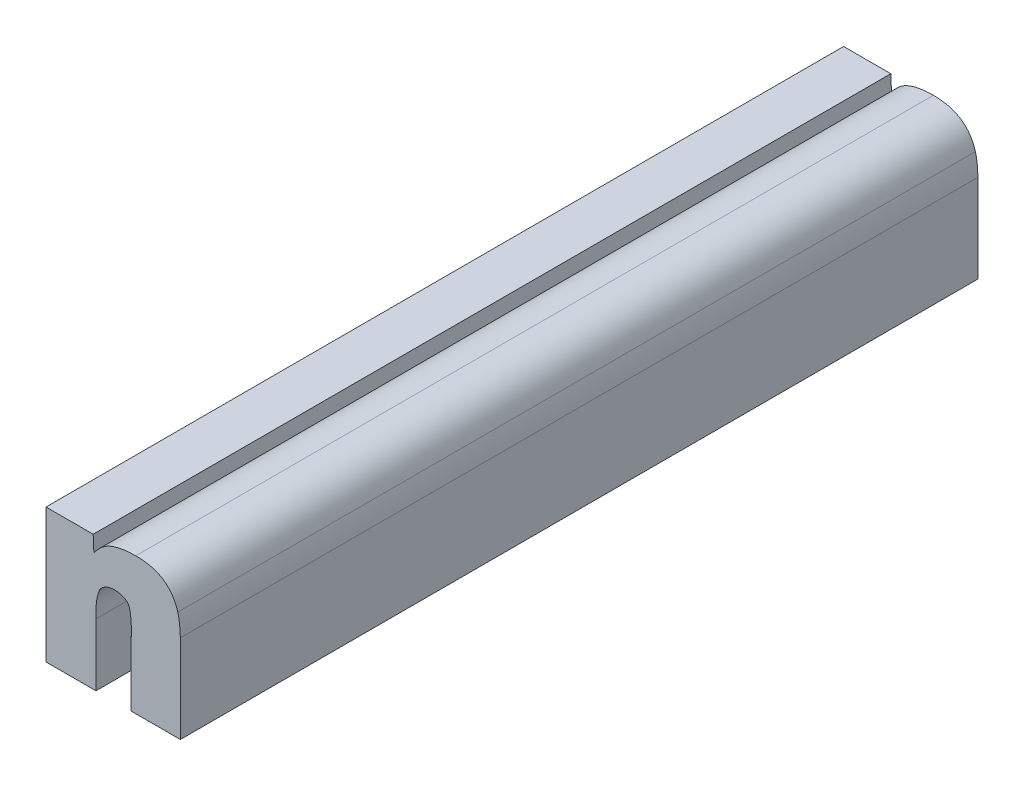
ISO-10303-21;
HEADER;
FILE_DESCRIPTION(('STEP AP214'),'2;1');
FILE_NAME('part.step','',(''),(''),'','','');
FILE_SCHEMA(('AUTOMOTIVE_DESIGN { 1 0 10303 214 1 1 1 1 }'));
ENDSEC;
DATA;
#1=APPLICATION_CONTEXT('core data for automotive mechanical design processes');
#2=APPLICATION_PROTOCOL_DEFINITION('international standard','automotive_design',2000,#1);
#3=PRODUCT_CONTEXT('',#1,'mechanical');
#4=PRODUCT('Part','Part','',(#3));
#5=PRODUCT_RELATED_PRODUCT_CATEGORY('part','',(#4));
#6=PRODUCT_DEFINITION_FORMATION('','',#4);
#7=PRODUCT_DEFINITION_CONTEXT('part definition',#1,'design');
#8=PRODUCT_DEFINITION('design','',#6,#7);
#9=PRODUCT_DEFINITION_SHAPE('','',#8);
#10=(LENGTH_UNIT() NAMED_UNIT(*) SI_UNIT(.MILLI.,.METRE.));
#11=(NAMED_UNIT(*) PLANE_ANGLE_UNIT() SI_UNIT($,.RADIAN.));
#12=(NAMED_UNIT(*) SI_UNIT($,.STERADIAN.) SOLID_ANGLE_UNIT());
#13=UNCERTAINTY_MEASURE_WITH_UNIT(LENGTH_MEASURE(1.E-05),#10,'distance_accuracy_value','');
#14=(GEOMETRIC_REPRESENTATION_CONTEXT(3) GLOBAL_UNCERTAINTY_ASSIGNED_CONTEXT((#13)) GLOBAL_UNIT_ASSIGNED_CONTEXT((#10,
#11,#12)) REPRESENTATION_CONTEXT('',''));
#15=CARTESIAN_POINT('',(0.,0.,0.));
#16=DIRECTION('',(0.,0.,1.));
#17=DIRECTION('',(1.,0.,0.));
#18=AXIS2_PLACEMENT_3D('',#15,#16,#17);
#19=CARTESIAN_POINT('',(1.3371923271056,0.0341772309982742,0.));
#20=DIRECTION('',(-1.,0.,0.));
#21=DIRECTION('',(0.,-1.,0.));
#22=AXIS2_PLACEMENT_3D('',#19,#20,#21);
#23=PLANE('',#22);
#24=DIRECTION('',(0.,-1.,0.));
#25=VECTOR('',#24,1.);
#26=CARTESIAN_POINT('',(1.3371923271056,0.0341772309982742,0.));
#27=LINE('',#26,#25);
#28=CARTESIAN_POINT('',(1.3371923271056,0.0341772309982742,0.));
#29=VERTEX_POINT('',#28);
#30=CARTESIAN_POINT('',(1.3371923271056,0.0173482363776242,0.));
#31=VERTEX_POINT('',#30);
#32=EDGE_CURVE('E11',#29,#31,#27,.T.);
#33=ORIENTED_EDGE('',*,*,#32,.T.);
#34=DIRECTION('',(0.,0.,1.));
#35=VECTOR('',#34,1.);
#36=CARTESIAN_POINT('',(1.3371923271056,0.0173482363776242,0.));
#37=LINE('',#36,#35);
#38=CARTESIAN_POINT('',(1.3371923271056,0.0173482363776242,0.1));
#39=VERTEX_POINT('',#38);
#40=EDGE_CURVE('E24',#31,#39,#37,.T.);
#41=ORIENTED_EDGE('',*,*,#40,.T.);
#42=DIRECTION('',(0.,-1.,0.));
#43=VECTOR('',#42,1.);
#44=CARTESIAN_POINT('',(1.3371923271056,0.0341772309982742,0.1));
#45=LINE('',#44,#43);
#46=CARTESIAN_POINT('',(1.3371923271056,0.0341772309982742,0.1));
#47=VERTEX_POINT('',#46);
#48=EDGE_CURVE('E142',#47,#39,#45,.T.);
#49=ORIENTED_EDGE('',*,*,#48,.F.);
#50=DIRECTION('',(0.,0.,1.));
#51=VECTOR('',#50,1.);
#52=CARTESIAN_POINT('',(1.3371923271056,0.0341772309982742,0.));
#53=LINE('',#52,#51);
#54=EDGE_CURVE('E321',#29,#47,#53,.T.);
#55=ORIENTED_EDGE('',*,*,#54,.F.);
#56=EDGE_LOOP('',(#33,#41,#49,#55));
#57=FACE_BOUND('',#56,.T.);
#58=ADVANCED_FACE('F17',(#57),#23,.T.);
#59=CARTESIAN_POINT('',(1.3431074051493,0.0341772309982742,0.));
#60=DIRECTION('',(0.,1.,0.));
#61=DIRECTION('',(-1.,0.,0.));
#62=AXIS2_PLACEMENT_3D('',#59,#60,#61);
#63=PLANE('',#62);
#64=DIRECTION('',(-1.,0.,0.));
#65=VECTOR('',#64,1.);
#66=CARTESIAN_POINT('',(1.3431074051493,0.0341772309982742,0.));
#67=LINE('',#66,#65);
#68=CARTESIAN_POINT('',(1.3431074051493,0.0341772309982742,0.));
#69=VERTEX_POINT('',#68);
#70=EDGE_CURVE('E318',#69,#29,#67,.T.);
#71=ORIENTED_EDGE('',*,*,#70,.T.);
#72=ORIENTED_EDGE('',*,*,#54,.T.);
#73=DIRECTION('',(-1.,0.,0.));
#74=VECTOR('',#73,1.);
#75=CARTESIAN_POINT('',(1.3431074051493,0.0341772309982742,0.1));
#76=LINE('',#75,#74);
#77=CARTESIAN_POINT('',(1.3431074051493,0.0341772309982742,0.1));
#78=VERTEX_POINT('',#77);
#79=EDGE_CURVE('E316',#78,#47,#76,.T.);
#80=ORIENTED_EDGE('',*,*,#79,.F.);
#81=DIRECTION('',(0.,0.,1.));
#82=VECTOR('',#81,1.);
#83=CARTESIAN_POINT('',(1.3431074051493,0.0341772309982742,0.));
#84=LINE('',#83,#82);
#85=EDGE_CURVE('E313',#69,#78,#84,.T.);
#86=ORIENTED_EDGE('',*,*,#85,.F.);
#87=EDGE_LOOP('',(#71,#72,#80,#86));
#88=FACE_BOUND('',#87,.T.);
#89=ADVANCED_FACE('F359',(#88),#63,.T.);
#90=CARTESIAN_POINT('',(1.3431943933759,0.0322229346359742,0.));
#91=DIRECTION('',(0.999010842697868,0.0444672483081271,0.));
#92=DIRECTION('',(-0.0444672483081271,0.999010842697868,0.));
#93=AXIS2_PLACEMENT_3D('',#90,#91,#92);
#94=PLANE('',#93);
#95=DIRECTION('',(-0.0444672483081271,0.999010842697868,0.));
#96=VECTOR('',#95,1.);
#97=CARTESIAN_POINT('',(1.3431943933759,0.0322229346359742,0.));
#98=LINE('',#97,#96);
#99=CARTESIAN_POINT('',(1.3431943933759,0.0322229346359742,0.));
#100=VERTEX_POINT('',#99);
#101=EDGE_CURVE('E310',#100,#69,#98,.T.);
#102=ORIENTED_EDGE('',*,*,#101,.T.);
#103=ORIENTED_EDGE('',*,*,#85,.T.);
#104=DIRECTION('',(-0.0444672483081271,0.999010842697868,0.));
#105=VECTOR('',#104,1.);
#106=CARTESIAN_POINT('',(1.3431943933759,0.0322229346359742,0.1));
#107=LINE('',#106,#105);
#108=CARTESIAN_POINT('',(1.3431943933759,0.0322229346359742,0.1));
#109=VERTEX_POINT('',#108);
#110=EDGE_CURVE('E307',#109,#78,#107,.T.);
#111=ORIENTED_EDGE('',*,*,#110,.F.);
#112=DIRECTION('',(0.,0.,1.));
#113=VECTOR('',#112,1.);
#114=CARTESIAN_POINT('',(1.3431943933759,0.0322229346359742,0.));
#115=LINE('',#114,#113);
#116=EDGE_CURVE('E301',#100,#109,#115,.T.);
#117=ORIENTED_EDGE('',*,*,#116,.F.);
#118=EDGE_LOOP('',(#102,#103,#111,#117));
#119=FACE_BOUND('',#118,.T.);
#120=ADVANCED_FACE('F356',(#119),#94,.T.);
#121=CARTESIAN_POINT('',(1.3484425809153,0.0345019804122742,0.));
#122=CARTESIAN_POINT('',(1.3484425809153,0.0345019804122742,0.1));
#123=CARTESIAN_POINT('',(1.3449631214529,0.0345019804386324,0.));
#124=CARTESIAN_POINT('',(1.3449631214529,0.0345019804386324,0.1));
#125=CARTESIAN_POINT('',(1.3440062708754,0.0332174735107256,0.));
#126=CARTESIAN_POINT('',(1.3440062708754,0.0332174735107256,0.1));
#127=CARTESIAN_POINT('',(1.3431943933759,0.0322229346359742,0.));
#128=CARTESIAN_POINT('',(1.3431943933759,0.0322229346359742,0.1));
#129=B_SPLINE_SURFACE_WITH_KNOTS('',3,1,((#121,#122),(#123,#124),(#125,#126),(#127,#128)),
.UNSPECIFIED.,.F.,.F.,.F.,(4,4),(2,2),(0.,1.),(0.,0.01),.UNSPECIFIED.);
#130=CARTESIAN_POINT('',(1.3484425809153,0.0345019804122742,0.));
#131=CARTESIAN_POINT('',(1.3449631214529,0.0345019804386324,0.));
#132=CARTESIAN_POINT('',(1.3440062708754,0.0332174735107256,0.));
#133=CARTESIAN_POINT('',(1.3431943933759,0.0322229346359742,0.));
#134=B_SPLINE_CURVE_WITH_KNOTS('',3,(#130,#131,#132,#133),.UNSPECIFIED.,.F.,.F.,(4,4),(0.,1.),.UNSPECIFIED.);
#135=CARTESIAN_POINT('',(1.3484425809153,0.0345019804122742,0.));
#136=VERTEX_POINT('',#135);
#137=EDGE_CURVE('E293',#136,#100,#134,.T.);
#138=CARTESIAN_POINT('',(1.3484425809153,0.0345019804122742,0.1));
#139=CARTESIAN_POINT('',(1.3449631214529,0.0345019804386324,0.1));
#140=CARTESIAN_POINT('',(1.3440062708754,0.0332174735107256,0.1));
#141=CARTESIAN_POINT('',(1.3431943933759,0.0322229346359742,0.1));
#142=B_SPLINE_CURVE_WITH_KNOTS('',3,(#138,#139,#140,#141),.UNSPECIFIED.,.F.,.F.,(4,4),(0.,1.),.UNSPECIFIED.);
#143=CARTESIAN_POINT('',(1.3484425809153,0.0345019804122742,0.1));
#144=VERTEX_POINT('',#143);
#145=EDGE_CURVE('E288',#144,#109,#142,.T.);
#146=DIRECTION('',(0.,0.,1.));
#147=VECTOR('',#146,1.);
#148=CARTESIAN_POINT('',(1.3484425809153,0.0345019804122742,0.));
#149=LINE('',#148,#147);
#150=EDGE_CURVE('E282',#136,#144,#149,.T.);
#151=ORIENTED_EDGE('',*,*,#137,.T.);
#152=ORIENTED_EDGE('',*,*,#116,.T.);
#153=ORIENTED_EDGE('',*,*,#145,.F.);
#154=ORIENTED_EDGE('',*,*,#150,.F.);
#155=EDGE_LOOP('',(#151,#152,#153,#154));
#156=FACE_BOUND('',#155,.T.);
#157=ADVANCED_FACE('F353',(#156),#129,.T.);
#158=CARTESIAN_POINT('',(1.3537197678463,0.0310283168829742,0.));
#159=CARTESIAN_POINT('',(1.3537197678463,0.0310283168829742,0.1));
#160=CARTESIAN_POINT('',(1.3529368877207,0.0336118174063003,0.));
#161=CARTESIAN_POINT('',(1.3529368877207,0.0336118174063003,0.1));
#162=CARTESIAN_POINT('',(1.3509941891386,0.0345019803742512,0.));
#163=CARTESIAN_POINT('',(1.3509941891386,0.0345019803742512,0.1));
#164=CARTESIAN_POINT('',(1.3484425809153,0.0345019804122742,0.));
#165=CARTESIAN_POINT('',(1.3484425809153,0.0345019804122742,0.1));
#166=B_SPLINE_SURFACE_WITH_KNOTS('',3,1,((#158,#159),(#160,#161),(#162,#163),(#164,#165)),
.UNSPECIFIED.,.F.,.F.,.F.,(4,4),(2,2),(0.,1.),(0.,0.01),.UNSPECIFIED.);
#167=CARTESIAN_POINT('',(1.3537197678463,0.0310283168829742,0.));
#168=CARTESIAN_POINT('',(1.3529368877207,0.0336118174063003,0.));
#169=CARTESIAN_POINT('',(1.3509941891386,0.0345019803742512,0.));
#170=CARTESIAN_POINT('',(1.3484425809153,0.0345019804122742,0.));
#171=B_SPLINE_CURVE_WITH_KNOTS('',3,(#167,#168,#169,#170),.UNSPECIFIED.,.F.,.F.,(4,4),(0.,1.),.UNSPECIFIED.);
#172=CARTESIAN_POINT('',(1.3537197678463,0.0310283168829742,0.));
#173=VERTEX_POINT('',#172);
#174=EDGE_CURVE('E274',#173,#136,#171,.T.);
#175=CARTESIAN_POINT('',(1.3537197678463,0.0310283168829742,0.1));
#176=CARTESIAN_POINT('',(1.3529368877207,0.0336118174063003,0.1));
#177=CARTESIAN_POINT('',(1.3509941891386,0.0345019803742512,0.1));
#178=CARTESIAN_POINT('',(1.3484425809153,0.0345019804122742,0.1));
#179=B_SPLINE_CURVE_WITH_KNOTS('',3,(#175,#176,#177,#178),.UNSPECIFIED.,.F.,.F.,(4,4),(0.,1.),.UNSPECIFIED.);
#180=CARTESIAN_POINT('',(1.3537197678463,0.0310283168829742,0.1));
#181=VERTEX_POINT('',#180);
#182=EDGE_CURVE('E269',#181,#144,#179,.T.);
#183=DIRECTION('',(0.,0.,1.));
#184=VECTOR('',#183,1.);
#185=CARTESIAN_POINT('',(1.3537197678463,0.0310283168829742,0.));
#186=LINE('',#185,#184);
#187=EDGE_CURVE('E263',#173,#181,#186,.T.);
#188=ORIENTED_EDGE('',*,*,#174,.T.);
#189=ORIENTED_EDGE('',*,*,#150,.T.);
#190=ORIENTED_EDGE('',*,*,#182,.F.);
#191=ORIENTED_EDGE('',*,*,#187,.F.);
#192=EDGE_LOOP('',(#188,#189,#190,#191));
#193=FACE_BOUND('',#192,.T.);
#194=ADVANCED_FACE('F350',(#193),#166,.T.);
#195=CARTESIAN_POINT('',(1.3540387153923,0.0284042191339617,0.));
#196=CARTESIAN_POINT('',(1.3540387153923,0.0284042191339617,0.1));
#197=CARTESIAN_POINT('',(1.3539807245946,0.0297438159437731,0.));
#198=CARTESIAN_POINT('',(1.3539807245946,0.0297438159437731,0.1));
#199=CARTESIAN_POINT('',(1.3538937383444,0.0303759151349363,0.));
#200=CARTESIAN_POINT('',(1.3538937383444,0.0303759151349363,0.1));
#201=CARTESIAN_POINT('',(1.3537197678463,0.0310283168829742,0.));
#202=CARTESIAN_POINT('',(1.3537197678463,0.0310283168829742,0.1));
#203=B_SPLINE_SURFACE_WITH_KNOTS('',3,1,((#195,#196),(#197,#198),(#199,#200),(#201,#202)),
.UNSPECIFIED.,.F.,.F.,.F.,(4,4),(2,2),(0.,1.),(0.,0.01),.UNSPECIFIED.);
#204=CARTESIAN_POINT('',(1.3540387153923,0.0284042191339617,0.));
#205=CARTESIAN_POINT('',(1.3539807245946,0.0297438159437731,0.));
#206=CARTESIAN_POINT('',(1.3538937383444,0.0303759151349363,0.));
#207=CARTESIAN_POINT('',(1.3537197678463,0.0310283168829742,0.));
#208=B_SPLINE_CURVE_WITH_KNOTS('',3,(#204,#205,#206,#207),.UNSPECIFIED.,.F.,.F.,(4,4),(0.,1.),.UNSPECIFIED.);
#209=CARTESIAN_POINT('',(1.3540387153923,0.0284042191339617,0.));
#210=VERTEX_POINT('',#209);
#211=EDGE_CURVE('E255',#210,#173,#208,.T.);
#212=CARTESIAN_POINT('',(1.3540387153923,0.0284042191339617,0.1));
#213=CARTESIAN_POINT('',(1.3539807245946,0.0297438159437731,0.1));
#214=CARTESIAN_POINT('',(1.3538937383444,0.0303759151349363,0.1));
#215=CARTESIAN_POINT('',(1.3537197678463,0.0310283168829742,0.1));
#216=B_SPLINE_CURVE_WITH_KNOTS('',3,(#212,#213,#214,#215),.UNSPECIFIED.,.F.,.F.,(4,4),(0.,1.),.UNSPECIFIED.);
#217=CARTESIAN_POINT('',(1.3540387153923,0.0284042191339617,0.1));
#218=VERTEX_POINT('',#217);
#219=EDGE_CURVE('E250',#218,#181,#216,.T.);
#220=DIRECTION('',(0.,0.,1.));
#221=VECTOR('',#220,1.);
#222=CARTESIAN_POINT('',(1.3540387153923,0.0284042191339617,0.));
#223=LINE('',#222,#221);
#224=EDGE_CURVE('E247',#210,#218,#223,.T.);
#225=ORIENTED_EDGE('',*,*,#211,.T.);
#226=ORIENTED_EDGE('',*,*,#187,.T.);
#227=ORIENTED_EDGE('',*,*,#219,.F.);
#228=ORIENTED_EDGE('',*,*,#224,.F.);
#229=EDGE_LOOP('',(#225,#226,#227,#228));
#230=FACE_BOUND('',#229,.T.);
#231=ADVANCED_FACE('F347',(#230),#203,.T.);
#232=CARTESIAN_POINT('',(1.3540387153923,0.0173540322766242,0.));
#233=DIRECTION('',(1.,0.,0.));
#234=DIRECTION('',(0.,1.,0.));
#235=AXIS2_PLACEMENT_3D('',#232,#233,#234);
#236=PLANE('',#235);
#237=DIRECTION('',(0.,1.,0.));
#238=VECTOR('',#237,1.);
#239=CARTESIAN_POINT('',(1.3540387153923,0.0173540322766242,0.));
#240=LINE('',#239,#238);
#241=CARTESIAN_POINT('',(1.3540387153923,0.0173540322766242,0.));
#242=VERTEX_POINT('',#241);
#243=EDGE_CURVE('E244',#242,#210,#240,.T.);
#244=ORIENTED_EDGE('',*,*,#243,.T.);
#245=ORIENTED_EDGE('',*,*,#224,.T.);
#246=DIRECTION('',(0.,1.,0.));
#247=VECTOR('',#246,1.);
#248=CARTESIAN_POINT('',(1.3540387153923,0.0173540322766242,0.1));
#249=LINE('',#248,#247);
#250=CARTESIAN_POINT('',(1.3540387153923,0.0173540322766242,0.1));
#251=VERTEX_POINT('',#250);
#252=EDGE_CURVE('E241',#251,#218,#249,.T.);
#253=ORIENTED_EDGE('',*,*,#252,.F.);
#254=DIRECTION('',(0.,0.,1.));
#255=VECTOR('',#254,1.);
#256=CARTESIAN_POINT('',(1.3540387153923,0.0173540322766242,0.));
#257=LINE('',#256,#255);
#258=EDGE_CURVE('E238',#242,#251,#257,.T.);
#259=ORIENTED_EDGE('',*,*,#258,.F.);
#260=EDGE_LOOP('',(#244,#245,#253,#259));
#261=FACE_BOUND('',#260,.T.);
#262=ADVANCED_FACE('F344',(#261),#236,.T.);
#263=CARTESIAN_POINT('',(1.3478626746583,0.0173540322766242,0.));
#264=DIRECTION('',(0.,-1.,0.));
#265=DIRECTION('',(1.,0.,0.));
#266=AXIS2_PLACEMENT_3D('',#263,#264,#265);
#267=PLANE('',#266);
#268=DIRECTION('',(1.,0.,0.));
#269=VECTOR('',#268,1.);
#270=CARTESIAN_POINT('',(1.3478626746583,0.0173540322766242,0.));
#271=LINE('',#270,#269);
#272=CARTESIAN_POINT('',(1.3478626746583,0.0173540322766242,0.));
#273=VERTEX_POINT('',#272);
#274=EDGE_CURVE('E235',#273,#242,#271,.T.);
#275=ORIENTED_EDGE('',*,*,#274,.T.);
#276=ORIENTED_EDGE('',*,*,#258,.T.);
#277=DIRECTION('',(1.,0.,0.));
#278=VECTOR('',#277,1.);
#279=CARTESIAN_POINT('',(1.3478626746583,0.0173540322766242,0.1));
#280=LINE('',#279,#278);
#281=CARTESIAN_POINT('',(1.3478626746583,0.0173540322766242,0.1));
#282=VERTEX_POINT('',#281);
#283=EDGE_CURVE('E232',#282,#251,#280,.T.);
#284=ORIENTED_EDGE('',*,*,#283,.F.);
#285=DIRECTION('',(0.,0.,1.));
#286=VECTOR('',#285,1.);
#287=CARTESIAN_POINT('',(1.3478626746583,0.0173540322766242,0.));
#288=LINE('',#287,#286);
#289=EDGE_CURVE('E229',#273,#282,#288,.T.);
#290=ORIENTED_EDGE('',*,*,#289,.F.);
#291=EDGE_LOOP('',(#275,#276,#284,#290));
#292=FACE_BOUND('',#291,.T.);
#293=ADVANCED_FACE('F341',(#292),#267,.T.);
#294=CARTESIAN_POINT('',(1.3478626746583,0.0254843753419617,0.));
#295=DIRECTION('',(-1.,0.,0.));
#296=DIRECTION('',(0.,-1.,0.));
#297=AXIS2_PLACEMENT_3D('',#294,#295,#296);
#298=PLANE('',#297);
#299=DIRECTION('',(0.,-1.,0.));
#300=VECTOR('',#299,1.);
#301=CARTESIAN_POINT('',(1.3478626746583,0.0254843753419617,0.));
#302=LINE('',#301,#300);
#303=CARTESIAN_POINT('',(1.3478626746583,0.0254843753419617,0.));
#304=VERTEX_POINT('',#303);
#305=EDGE_CURVE('E226',#304,#273,#302,.T.);
#306=ORIENTED_EDGE('',*,*,#305,.T.);
#307=ORIENTED_EDGE('',*,*,#289,.T.);
#308=DIRECTION('',(0.,-1.,0.));
#309=VECTOR('',#308,1.);
#310=CARTESIAN_POINT('',(1.3478626746583,0.0254843753419617,0.1));
#311=LINE('',#310,#309);
#312=CARTESIAN_POINT('',(1.3478626746583,0.0254843753419617,0.1));
#313=VERTEX_POINT('',#312);
#314=EDGE_CURVE('E223',#313,#282,#311,.T.);
#315=ORIENTED_EDGE('',*,*,#314,.F.);
#316=DIRECTION('',(0.,0.,1.));
#317=VECTOR('',#316,1.);
#318=CARTESIAN_POINT('',(1.3478626746583,0.0254843753419617,0.));
#319=LINE('',#318,#317);
#320=EDGE_CURVE('E217',#304,#313,#319,.T.);
#321=ORIENTED_EDGE('',*,*,#320,.F.);
#322=EDGE_LOOP('',(#306,#307,#315,#321));
#323=FACE_BOUND('',#322,.T.);
#324=ADVANCED_FACE('F338',(#323),#298,.T.);
#325=CARTESIAN_POINT('',(1.3472537709993,0.0290682226319617,0.));
#326=CARTESIAN_POINT('',(1.3472537709993,0.0290682226319617,0.1));
#327=CARTESIAN_POINT('',(1.3481236333024,0.0286593859307982,0.));
#328=CARTESIAN_POINT('',(1.3481236333024,0.0286593859307982,0.1));
#329=CARTESIAN_POINT('',(1.3478626746787,0.024515926978292,0.));
#330=CARTESIAN_POINT('',(1.3478626746787,0.024515926978292,0.1));
#331=CARTESIAN_POINT('',(1.3478626746583,0.0254843753419617,0.));
#332=CARTESIAN_POINT('',(1.3478626746583,0.0254843753419617,0.1));
#333=B_SPLINE_SURFACE_WITH_KNOTS('',3,1,((#325,#326),(#327,#328),(#329,#330),(#331,#332)),
.UNSPECIFIED.,.F.,.F.,.F.,(4,4),(2,2),(0.,1.),(0.,0.01),.UNSPECIFIED.);
#334=CARTESIAN_POINT('',(1.3472537709993,0.0290682226319617,0.));
#335=CARTESIAN_POINT('',(1.3481236333024,0.0286593859307982,0.));
#336=CARTESIAN_POINT('',(1.3478626746787,0.024515926978292,0.));
#337=CARTESIAN_POINT('',(1.3478626746583,0.0254843753419617,0.));
#338=B_SPLINE_CURVE_WITH_KNOTS('',3,(#334,#335,#336,#337),.UNSPECIFIED.,.F.,.F.,(4,4),(0.,1.),.UNSPECIFIED.);
#339=CARTESIAN_POINT('',(1.3472537709993,0.0290682226319617,0.));
#340=VERTEX_POINT('',#339);
#341=EDGE_CURVE('E209',#340,#304,#338,.T.);
#342=CARTESIAN_POINT('',(1.3472537709993,0.0290682226319617,0.1));
#343=CARTESIAN_POINT('',(1.3481236333024,0.0286593859307982,0.1));
#344=CARTESIAN_POINT('',(1.3478626746787,0.024515926978292,0.1));
#345=CARTESIAN_POINT('',(1.3478626746583,0.0254843753419617,0.1));
#346=B_SPLINE_CURVE_WITH_KNOTS('',3,(#342,#343,#344,#345),.UNSPECIFIED.,.F.,.F.,(4,4),(0.,1.),.UNSPECIFIED.);
#347=CARTESIAN_POINT('',(1.3472537709993,0.0290682226319617,0.1));
#348=VERTEX_POINT('',#347);
#349=EDGE_CURVE('E204',#348,#313,#346,.T.);
#350=DIRECTION('',(0.,0.,1.));
#351=VECTOR('',#350,1.);
#352=CARTESIAN_POINT('',(1.3472537709993,0.0290682226319617,0.));
#353=LINE('',#352,#351);
#354=EDGE_CURVE('E198',#340,#348,#353,.T.);
#355=CARTESIAN_POINT('',(1.3472537709993,0.0290682226319617,0.));
#356=CARTESIAN_POINT('',(1.3472537709993,0.0290682226319617,0.1));
#357=CARTESIAN_POINT('',(1.3481236333024,0.0286593859307982,0.));
#358=CARTESIAN_POINT('',(1.3481236333024,0.0286593859307982,0.1));
#359=CARTESIAN_POINT('',(1.3478626746787,0.024515926978292,0.));
#360=CARTESIAN_POINT('',(1.3478626746787,0.024515926978292,0.1));
#361=CARTESIAN_POINT('',(1.3478626746583,0.0254843753419617,0.));
#362=CARTESIAN_POINT('',(1.3478626746583,0.0254843753419617,0.1));
#363=CARTESIAN_POINT('',(1.34786267465655,0.0255676619012373,0.));
#364=CARTESIAN_POINT('',(1.34786267465655,0.0255676619012373,0.1));
#365=CARTESIAN_POINT('',(1.34786267465479,0.0256509484605129,0.));
#366=CARTESIAN_POINT('',(1.34786267465479,0.0256509484605129,0.1));
#367=CARTESIAN_POINT('',(1.34786267465304,0.0257342350197885,0.));
#368=CARTESIAN_POINT('',(1.34786267465304,0.0257342350197885,0.1));
#369=B_SPLINE_SURFACE_WITH_KNOTS('',3,1,((#355,#356),(#357,#358),(#359,#360),(#361,#362),(#363,
#364),(#365,#366),(#367,#368)),.UNSPECIFIED.,.F.,.F.,.F.,(4,3,4),(2,2),(0.,1.,1.086),(0.,0.01),.UNSPECIFIED.);
#370=ORIENTED_EDGE('',*,*,#341,.T.);
#371=ORIENTED_EDGE('',*,*,#320,.T.);
#372=ORIENTED_EDGE('',*,*,#349,.F.);
#373=ORIENTED_EDGE('',*,*,#354,.F.);
#374=EDGE_LOOP('',(#370,#371,#372,#373));
#375=FACE_BOUND('',#374,.T.);
#376=ADVANCED_FACE('F335',(#375),#369,.T.);
#377=CARTESIAN_POINT('',(1.3457460015993,0.0294770553592952,0.));
#378=CARTESIAN_POINT('',(1.3457460015993,0.0294770553592952,0.1));
#379=CARTESIAN_POINT('',(1.3464128960892,0.0294915580521543,0.));
#380=CARTESIAN_POINT('',(1.3464128960892,0.0294915580521543,0.1));
#381=CARTESIAN_POINT('',(1.3469638148883,0.0292103007536139,0.));
#382=CARTESIAN_POINT('',(1.3469638148883,0.0292103007536139,0.1));
#383=CARTESIAN_POINT('',(1.3472537709993,0.0290682226319617,0.));
#384=CARTESIAN_POINT('',(1.3472537709993,0.0290682226319617,0.1));
#385=B_SPLINE_SURFACE_WITH_KNOTS('',3,1,((#377,#378),(#379,#380),(#381,#382),(#383,#384)),
.UNSPECIFIED.,.F.,.F.,.F.,(4,4),(2,2),(0.,1.),(0.,0.01),.UNSPECIFIED.);
#386=CARTESIAN_POINT('',(1.3457460015993,0.0294770553592952,0.));
#387=CARTESIAN_POINT('',(1.3464128960892,0.0294915580521543,0.));
#388=CARTESIAN_POINT('',(1.3469638148883,0.0292103007536139,0.));
#389=CARTESIAN_POINT('',(1.3472537709993,0.0290682226319617,0.));
#390=B_SPLINE_CURVE_WITH_KNOTS('',3,(#386,#387,#388,#389),.UNSPECIFIED.,.F.,.F.,(4,4),(0.,1.),.UNSPECIFIED.);
#391=CARTESIAN_POINT('',(1.3457460015993,0.0294770553592952,0.));
#392=VERTEX_POINT('',#391);
#393=EDGE_CURVE('E190',#392,#340,#390,.T.);
#394=CARTESIAN_POINT('',(1.3457460015993,0.0294770553592952,0.1));
#395=CARTESIAN_POINT('',(1.3464128960892,0.0294915580521543,0.1));
#396=CARTESIAN_POINT('',(1.3469638148883,0.0292103007536139,0.1));
#397=CARTESIAN_POINT('',(1.3472537709993,0.0290682226319617,0.1));
#398=B_SPLINE_CURVE_WITH_KNOTS('',3,(#394,#395,#396,#397),.UNSPECIFIED.,.F.,.F.,(4,4),(0.,1.),.UNSPECIFIED.);
#399=CARTESIAN_POINT('',(1.3457460015993,0.0294770553592952,0.1));
#400=VERTEX_POINT('',#399);
#401=EDGE_CURVE('E185',#400,#348,#398,.T.);
#402=DIRECTION('',(0.,0.,1.));
#403=VECTOR('',#402,1.);
#404=CARTESIAN_POINT('',(1.3457460015993,0.0294770553592952,0.));
#405=LINE('',#404,#403);
#406=EDGE_CURVE('E179',#392,#400,#405,.T.);
#407=ORIENTED_EDGE('',*,*,#393,.T.);
#408=ORIENTED_EDGE('',*,*,#354,.T.);
#409=ORIENTED_EDGE('',*,*,#401,.F.);
#410=ORIENTED_EDGE('',*,*,#406,.F.);
#411=EDGE_LOOP('',(#407,#408,#409,#410));
#412=FACE_BOUND('',#411,.T.);
#413=ADVANCED_FACE('F332',(#412),#385,.T.);
#414=CARTESIAN_POINT('',(1.3438612918389,0.0284274206369617,0.));
#415=CARTESIAN_POINT('',(1.3438612918389,0.0284274206369617,0.1));
#416=CARTESIAN_POINT('',(1.3441512479519,0.0290972160546295,0.));
#417=CARTESIAN_POINT('',(1.3441512479519,0.0290972160546295,0.1));
#418=CARTESIAN_POINT('',(1.3449921188889,0.0294625606376275,0.));
#419=CARTESIAN_POINT('',(1.3449921188889,0.0294625606376275,0.1));
#420=CARTESIAN_POINT('',(1.3457460015993,0.0294770553592952,0.));
#421=CARTESIAN_POINT('',(1.3457460015993,0.0294770553592952,0.1));
#422=B_SPLINE_SURFACE_WITH_KNOTS('',3,1,((#414,#415),(#416,#417),(#418,#419),(#420,#421)),
.UNSPECIFIED.,.F.,.F.,.F.,(4,4),(2,2),(0.,1.),(0.,0.01),.UNSPECIFIED.);
#423=CARTESIAN_POINT('',(1.3438612918389,0.0284274206369617,0.));
#424=CARTESIAN_POINT('',(1.3441512479519,0.0290972160546295,0.));
#425=CARTESIAN_POINT('',(1.3449921188889,0.0294625606376275,0.));
#426=CARTESIAN_POINT('',(1.3457460015993,0.0294770553592952,0.));
#427=B_SPLINE_CURVE_WITH_KNOTS('',3,(#423,#424,#425,#426),.UNSPECIFIED.,.F.,.F.,(4,4),(0.,1.),.UNSPECIFIED.);
#428=CARTESIAN_POINT('',(1.3438612918389,0.0284274206369617,0.));
#429=VERTEX_POINT('',#428);
#430=EDGE_CURVE('E171',#429,#392,#427,.T.);
#431=CARTESIAN_POINT('',(1.3438612918389,0.0284274206369617,0.1));
#432=CARTESIAN_POINT('',(1.3441512479519,0.0290972160546295,0.1));
#433=CARTESIAN_POINT('',(1.3449921188889,0.0294625606376275,0.1));
#434=CARTESIAN_POINT('',(1.3457460015993,0.0294770553592952,0.1));
#435=B_SPLINE_CURVE_WITH_KNOTS('',3,(#431,#432,#433,#434),.UNSPECIFIED.,.F.,.F.,(4,4),(0.,1.),.UNSPECIFIED.);
#436=CARTESIAN_POINT('',(1.3438612918389,0.0284274206369617,0.1));
#437=VERTEX_POINT('',#436);
#438=EDGE_CURVE('E166',#437,#400,#435,.T.);
#439=DIRECTION('',(0.,0.,1.));
#440=VECTOR('',#439,1.);
#441=CARTESIAN_POINT('',(1.3438612918389,0.0284274206369617,0.));
#442=LINE('',#441,#440);
#443=EDGE_CURVE('E160',#429,#437,#442,.T.);
#444=ORIENTED_EDGE('',*,*,#430,.T.);
#445=ORIENTED_EDGE('',*,*,#406,.T.);
#446=ORIENTED_EDGE('',*,*,#438,.F.);
#447=ORIENTED_EDGE('',*,*,#443,.F.);
#448=EDGE_LOOP('',(#444,#445,#446,#447));
#449=FACE_BOUND('',#448,.T.);
#450=ADVANCED_FACE('F329',(#449),#422,.T.);
#451=CARTESIAN_POINT('',(1.3434553520869,0.0251567249939619,0.));
#452=CARTESIAN_POINT('',(1.3434553520869,0.0251567249939619,0.1));
#453=CARTESIAN_POINT('',(1.3434263646332,0.0268587654472916,0.));
#454=CARTESIAN_POINT('',(1.3434263646332,0.0268587654472916,0.1));
#455=CARTESIAN_POINT('',(1.3435423383239,0.0276097472236314,0.));
#456=CARTESIAN_POINT('',(1.3435423383239,0.0276097472236314,0.1));
#457=CARTESIAN_POINT('',(1.3438612918389,0.0284274206369617,0.));
#458=CARTESIAN_POINT('',(1.3438612918389,0.0284274206369617,0.1));
#459=B_SPLINE_SURFACE_WITH_KNOTS('',3,1,((#451,#452),(#453,#454),(#455,#456),(#457,#458)),
.UNSPECIFIED.,.F.,.F.,.F.,(4,4),(2,2),(0.,1.),(0.,0.01),.UNSPECIFIED.);
#460=CARTESIAN_POINT('',(1.3434553520869,0.0251567249939619,0.));
#461=CARTESIAN_POINT('',(1.3434263646332,0.0268587654472916,0.));
#462=CARTESIAN_POINT('',(1.3435423383239,0.0276097472236314,0.));
#463=CARTESIAN_POINT('',(1.3438612918389,0.0284274206369617,0.));
#464=B_SPLINE_CURVE_WITH_KNOTS('',3,(#460,#461,#462,#463),.UNSPECIFIED.,.F.,.F.,(4,4),(0.,1.),.UNSPECIFIED.);
#465=CARTESIAN_POINT('',(1.3434553520869,0.0251567249939619,0.));
#466=VERTEX_POINT('',#465);
#467=EDGE_CURVE('E152',#466,#429,#464,.T.);
#468=CARTESIAN_POINT('',(1.3434553520869,0.0251567249939619,0.1));
#469=CARTESIAN_POINT('',(1.3434263646332,0.0268587654472916,0.1));
#470=CARTESIAN_POINT('',(1.3435423383239,0.0276097472236314,0.1));
#471=CARTESIAN_POINT('',(1.3438612918389,0.0284274206369617,0.1));
#472=B_SPLINE_CURVE_WITH_KNOTS('',3,(#468,#469,#470,#471),.UNSPECIFIED.,.F.,.F.,(4,4),(0.,1.),.UNSPECIFIED.);
#473=CARTESIAN_POINT('',(1.3434553520869,0.0251567249939619,0.1));
#474=VERTEX_POINT('',#473);
#475=EDGE_CURVE('E148',#474,#437,#472,.T.);
#476=DIRECTION('',(0.,0.,1.));
#477=VECTOR('',#476,1.);
#478=CARTESIAN_POINT('',(1.3434553520869,0.0251567249939619,0.));
#479=LINE('',#478,#477);
#480=EDGE_CURVE('E127',#466,#474,#479,.T.);
#481=ORIENTED_EDGE('',*,*,#467,.T.);
#482=ORIENTED_EDGE('',*,*,#443,.T.);
#483=ORIENTED_EDGE('',*,*,#475,.F.);
#484=ORIENTED_EDGE('',*,*,#480,.F.);
#485=EDGE_LOOP('',(#481,#482,#483,#484));
#486=FACE_BOUND('',#485,.T.);
#487=ADVANCED_FACE('F327',(#486),#459,.T.);
#488=CARTESIAN_POINT('',(1.3434553520869,0.0173482363776242,0.));
#489=DIRECTION('',(1.,0.,0.));
#490=DIRECTION('',(0.,1.,0.));
#491=AXIS2_PLACEMENT_3D('',#488,#489,#490);
#492=PLANE('',#491);
#493=DIRECTION('',(0.,1.,0.));
#494=VECTOR('',#493,1.);
#495=CARTESIAN_POINT('',(1.3434553520869,0.0173482363776242,0.));
#496=LINE('',#495,#494);
#497=CARTESIAN_POINT('',(1.3434553520869,0.0173482363776242,0.));
#498=VERTEX_POINT('',#497);
#499=EDGE_CURVE('E131',#498,#466,#496,.T.);
#500=ORIENTED_EDGE('',*,*,#499,.T.);
#501=ORIENTED_EDGE('',*,*,#480,.T.);
#502=DIRECTION('',(0.,1.,0.));
#503=VECTOR('',#502,1.);
#504=CARTESIAN_POINT('',(1.3434553520869,0.0173482363776242,0.1));
#505=LINE('',#504,#503);
#506=CARTESIAN_POINT('',(1.3434553520869,0.0173482363776242,0.1));
#507=VERTEX_POINT('',#506);
#508=EDGE_CURVE('E120',#507,#474,#505,.T.);
#509=ORIENTED_EDGE('',*,*,#508,.F.);
#510=DIRECTION('',(0.,0.,1.));
#511=VECTOR('',#510,1.);
#512=CARTESIAN_POINT('',(1.3434553520869,0.0173482363776242,0.));
#513=LINE('',#512,#511);
#514=EDGE_CURVE('E124',#498,#507,#513,.T.);
#515=ORIENTED_EDGE('',*,*,#514,.F.);
#516=EDGE_LOOP('',(#500,#501,#509,#515));
#517=FACE_BOUND('',#516,.T.);
#518=ADVANCED_FACE('F123',(#517),#492,.T.);
#519=CARTESIAN_POINT('',(1.3371923271056,0.0173482363776242,0.));
#520=DIRECTION('',(0.,-1.,0.));
#521=DIRECTION('',(1.,0.,0.));
#522=AXIS2_PLACEMENT_3D('',#519,#520,#521);
#523=PLANE('',#522);
#524=DIRECTION('',(1.,0.,0.));
#525=VECTOR('',#524,1.);
#526=CARTESIAN_POINT('',(1.3371923271056,0.0173482363776242,0.));
#527=LINE('',#526,#525);
#528=EDGE_CURVE('E137',#31,#498,#527,.T.);
#529=ORIENTED_EDGE('',*,*,#528,.T.);
#530=ORIENTED_EDGE('',*,*,#514,.T.);
#531=DIRECTION('',(1.,0.,0.));
#532=VECTOR('',#531,1.);
#533=CARTESIAN_POINT('',(1.3371923271056,0.0173482363776242,0.1));
#534=LINE('',#533,#532);
#535=EDGE_CURVE('E136',#39,#507,#534,.T.);
#536=ORIENTED_EDGE('',*,*,#535,.F.);
#537=ORIENTED_EDGE('',*,*,#40,.F.);
#538=EDGE_LOOP('',(#529,#530,#536,#537));
#539=FACE_BOUND('',#538,.T.);
#540=ADVANCED_FACE('F135',(#539),#523,.T.);
#541=CARTESIAN_POINT('',(1.3451774934432,0.0252564442534349,0.1));
#542=DIRECTION('',(0.,0.,1.));
#543=DIRECTION('',(1.,0.,0.));
#544=AXIS2_PLACEMENT_3D('',#541,#542,#543);
#545=PLANE('',#544);
#546=ORIENTED_EDGE('',*,*,#535,.T.);
#547=ORIENTED_EDGE('',*,*,#508,.T.);
#548=ORIENTED_EDGE('',*,*,#475,.T.);
#549=ORIENTED_EDGE('',*,*,#438,.T.);
#550=ORIENTED_EDGE('',*,*,#401,.T.);
#551=ORIENTED_EDGE('',*,*,#349,.T.);
#552=ORIENTED_EDGE('',*,*,#314,.T.);
#553=ORIENTED_EDGE('',*,*,#283,.T.);
#554=ORIENTED_EDGE('',*,*,#252,.T.);
#555=ORIENTED_EDGE('',*,*,#219,.T.);
#556=ORIENTED_EDGE('',*,*,#182,.T.);
#557=ORIENTED_EDGE('',*,*,#145,.T.);
#558=ORIENTED_EDGE('',*,*,#110,.T.);
#559=ORIENTED_EDGE('',*,*,#79,.T.);
#560=ORIENTED_EDGE('',*,*,#48,.T.);
#561=EDGE_LOOP('',(#546,#547,#548,#549,#550,#551,#552,#553,#554,#555,#556,#557,#558,#559,#560));
#562=FACE_BOUND('',#561,.T.);
#563=ADVANCED_FACE('F140',(#562),#545,.T.);
#564=CARTESIAN_POINT('',(1.3451774934432,0.0252564442534349,0.));
#565=DIRECTION('',(0.,0.,1.));
#566=DIRECTION('',(1.,0.,0.));
#567=AXIS2_PLACEMENT_3D('',#564,#565,#566);
#568=PLANE('',#567);
#569=ORIENTED_EDGE('',*,*,#528,.F.);
#570=ORIENTED_EDGE('',*,*,#32,.F.);
#571=ORIENTED_EDGE('',*,*,#70,.F.);
#572=ORIENTED_EDGE('',*,*,#101,.F.);
#573=ORIENTED_EDGE('',*,*,#137,.F.);
#574=ORIENTED_EDGE('',*,*,#174,.F.);
#575=ORIENTED_EDGE('',*,*,#211,.F.);
#576=ORIENTED_EDGE('',*,*,#243,.F.);
#577=ORIENTED_EDGE('',*,*,#274,.F.);
#578=ORIENTED_EDGE('',*,*,#305,.F.);
#579=ORIENTED_EDGE('',*,*,#341,.F.);
#580=ORIENTED_EDGE('',*,*,#393,.F.);
#581=ORIENTED_EDGE('',*,*,#430,.F.);
#582=ORIENTED_EDGE('',*,*,#467,.F.);
#583=ORIENTED_EDGE('',*,*,#499,.F.);
#584=EDGE_LOOP('',(#569,#570,#571,#572,#573,#574,#575,#576,#577,#578,#579,#580,#581,#582,#583));
#585=FACE_BOUND('',#584,.T.);
#586=ADVANCED_FACE('F324',(#585),#568,.F.);
#587=CLOSED_SHELL('',(#58,#89,#120,#157,#194,#231,#262,#293,#324,#376,#413,#450,#487,#518,#540,
#563,#586));
#588=MANIFOLD_SOLID_BREP('B1',#587);
#589=ADVANCED_BREP_SHAPE_REPRESENTATION('',(#18,#588),#14);
#590=SHAPE_DEFINITION_REPRESENTATION(#9,#589);
ENDSEC;
END-ISO-10303-21;
